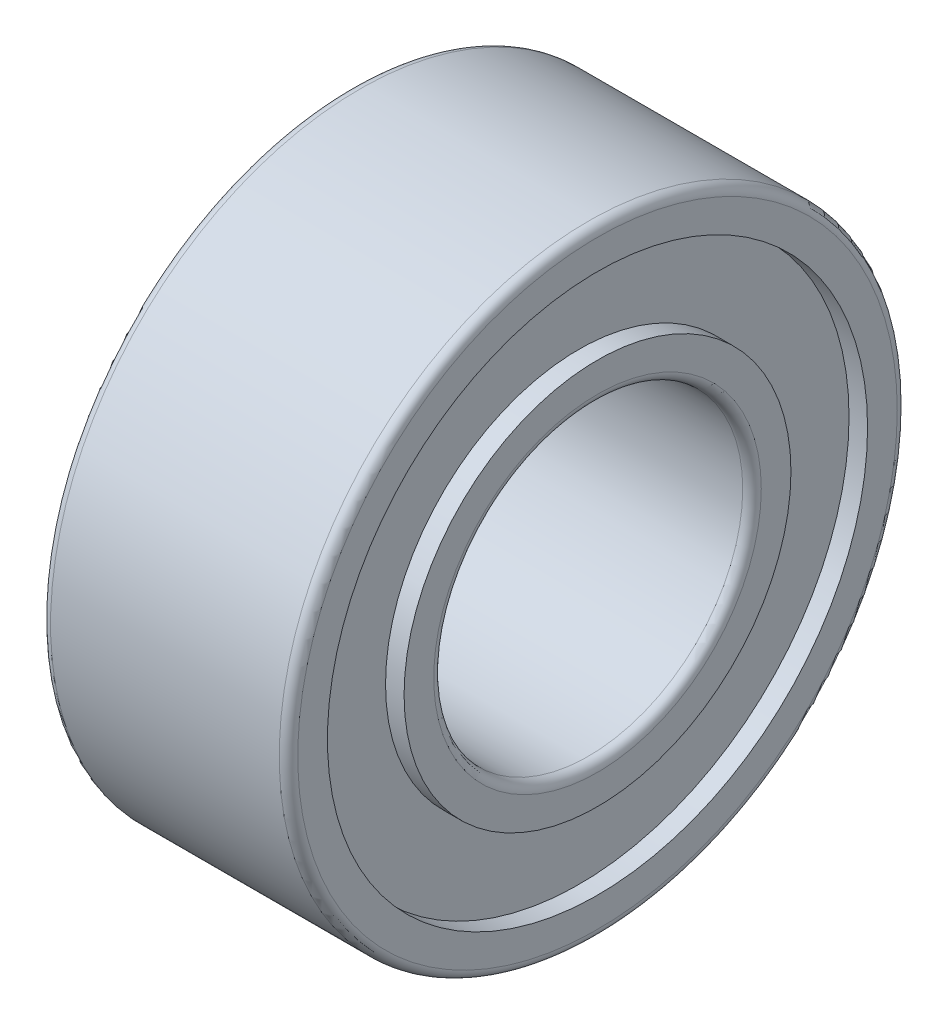
ISO-10303-21;
HEADER;
FILE_DESCRIPTION(('STEP AP214'),'2;1');
FILE_NAME('part.step','',(''),(''),'','','');
FILE_SCHEMA(('AUTOMOTIVE_DESIGN { 1 0 10303 214 1 1 1 1 }'));
ENDSEC;
DATA;
#1=APPLICATION_CONTEXT('core data for automotive mechanical design processes');
#2=APPLICATION_PROTOCOL_DEFINITION('international standard','automotive_design',2000,#1);
#3=PRODUCT_CONTEXT('',#1,'mechanical');
#4=PRODUCT('Part','Part','',(#3));
#5=PRODUCT_RELATED_PRODUCT_CATEGORY('part','',(#4));
#6=PRODUCT_DEFINITION_FORMATION('','',#4);
#7=PRODUCT_DEFINITION_CONTEXT('part definition',#1,'design');
#8=PRODUCT_DEFINITION('design','',#6,#7);
#9=PRODUCT_DEFINITION_SHAPE('','',#8);
#10=(LENGTH_UNIT() NAMED_UNIT(*) SI_UNIT(.MILLI.,.METRE.));
#11=(NAMED_UNIT(*) PLANE_ANGLE_UNIT() SI_UNIT($,.RADIAN.));
#12=(NAMED_UNIT(*) SI_UNIT($,.STERADIAN.) SOLID_ANGLE_UNIT());
#13=UNCERTAINTY_MEASURE_WITH_UNIT(LENGTH_MEASURE(1.E-05),#10,'distance_accuracy_value','');
#14=(GEOMETRIC_REPRESENTATION_CONTEXT(3) GLOBAL_UNCERTAINTY_ASSIGNED_CONTEXT((#13)) GLOBAL_UNIT_ASSIGNED_CONTEXT((#10,
#11,#12)) REPRESENTATION_CONTEXT('',''));
#15=CARTESIAN_POINT('',(0.,0.,0.));
#16=DIRECTION('',(0.,0.,1.));
#17=DIRECTION('',(1.,0.,0.));
#18=AXIS2_PLACEMENT_3D('',#15,#16,#17);
#19=CARTESIAN_POINT('',(3.7,0.,4.37));
#20=DIRECTION('',(1.,0.,0.));
#21=DIRECTION('',(0.,1.,0.));
#22=AXIS2_PLACEMENT_3D('',#19,#20,#21);
#23=PLANE('',#22);
#24=CARTESIAN_POINT('',(3.7,0.,0.));
#25=DIRECTION('',(-1.,0.,0.));
#26=DIRECTION('',(0.,0.,1.));
#27=AXIS2_PLACEMENT_3D('',#24,#25,#26);
#28=CIRCLE('',#27,3.13);
#29=CARTESIAN_POINT('',(3.7,0.,-3.13));
#30=VERTEX_POINT('',#29);
#31=EDGE_CURVE('E25',#30,#30,#28,.T.);
#32=ORIENTED_EDGE('',*,*,#31,.T.);
#33=EDGE_LOOP('',(#32));
#34=FACE_BOUND('',#33,.T.);
#35=CARTESIAN_POINT('',(3.7,0.,0.));
#36=DIRECTION('',(-1.,0.,0.));
#37=DIRECTION('',(0.,0.,1.));
#38=AXIS2_PLACEMENT_3D('',#35,#36,#37);
#39=CIRCLE('',#38,4.37);
#40=CARTESIAN_POINT('',(3.7,0.,-4.37));
#41=VERTEX_POINT('',#40);
#42=EDGE_CURVE('E128',#41,#41,#39,.T.);
#43=ORIENTED_EDGE('',*,*,#42,.F.);
#44=EDGE_LOOP('',(#43));
#45=FACE_BOUND('',#44,.T.);
#46=ADVANCED_FACE('F16',(#34,#45),#23,.T.);
#47=CARTESIAN_POINT('',(3.85,0.,0.));
#48=DIRECTION('',(-1.,0.,0.));
#49=DIRECTION('',(0.,0.,1.));
#50=AXIS2_PLACEMENT_3D('',#47,#48,#49);
#51=CYLINDRICAL_SURFACE('',#50,3.13);
#52=ORIENTED_EDGE('',*,*,#31,.F.);
#53=DIRECTION('',(1.,0.,0.));
#54=VECTOR('',#53,1.);
#55=CARTESIAN_POINT('',(3.85,0.,-3.13));
#56=LINE('',#55,#54);
#57=CARTESIAN_POINT('',(4.,0.,-3.13));
#58=VERTEX_POINT('',#57);
#59=EDGE_CURVE('E10',#30,#58,#56,.T.);
#60=ORIENTED_EDGE('',*,*,#59,.T.);
#61=CARTESIAN_POINT('',(4.,0.,0.));
#62=DIRECTION('',(-1.,0.,0.));
#63=DIRECTION('',(0.,0.,1.));
#64=AXIS2_PLACEMENT_3D('',#61,#62,#63);
#65=CIRCLE('',#64,3.13);
#66=EDGE_CURVE('E352',#58,#58,#65,.T.);
#67=ORIENTED_EDGE('',*,*,#66,.T.);
#68=ORIENTED_EDGE('',*,*,#59,.F.);
#69=EDGE_LOOP('',(#52,#60,#67,#68));
#70=FACE_BOUND('',#69,.T.);
#71=ADVANCED_FACE('F177',(#70),#51,.T.);
#72=CARTESIAN_POINT('',(0.15,0.,0.));
#73=DIRECTION('',(-1.,0.,0.));
#74=DIRECTION('',(0.,0.,1.));
#75=AXIS2_PLACEMENT_3D('',#72,#73,#74);
#76=CYLINDRICAL_SURFACE('',#75,3.13);
#77=CARTESIAN_POINT('',(0.,0.,0.));
#78=DIRECTION('',(-1.,0.,0.));
#79=DIRECTION('',(0.,0.,1.));
#80=AXIS2_PLACEMENT_3D('',#77,#78,#79);
#81=CIRCLE('',#80,3.13);
#82=CARTESIAN_POINT('',(0.,0.,-3.13));
#83=VERTEX_POINT('',#82);
#84=EDGE_CURVE('E130',#83,#83,#81,.T.);
#85=ORIENTED_EDGE('',*,*,#84,.F.);
#86=DIRECTION('',(1.,0.,0.));
#87=VECTOR('',#86,1.);
#88=CARTESIAN_POINT('',(0.15,0.,-3.13));
#89=LINE('',#88,#87);
#90=CARTESIAN_POINT('',(0.3,0.,-3.13));
#91=VERTEX_POINT('',#90);
#92=EDGE_CURVE('E110',#83,#91,#89,.T.);
#93=ORIENTED_EDGE('',*,*,#92,.T.);
#94=CARTESIAN_POINT('',(0.3,0.,0.));
#95=DIRECTION('',(-1.,0.,0.));
#96=DIRECTION('',(0.,0.,1.));
#97=AXIS2_PLACEMENT_3D('',#94,#95,#96);
#98=CIRCLE('',#97,3.13);
#99=EDGE_CURVE('E99',#91,#91,#98,.T.);
#100=ORIENTED_EDGE('',*,*,#99,.T.);
#101=ORIENTED_EDGE('',*,*,#92,.F.);
#102=EDGE_LOOP('',(#85,#93,#100,#101));
#103=FACE_BOUND('',#102,.T.);
#104=ADVANCED_FACE('F170',(#103),#76,.T.);
#105=CARTESIAN_POINT('',(0.3,0.,3.13));
#106=DIRECTION('',(-1.,0.,0.));
#107=DIRECTION('',(0.,0.,1.));
#108=AXIS2_PLACEMENT_3D('',#105,#106,#107);
#109=PLANE('',#108);
#110=ORIENTED_EDGE('',*,*,#99,.F.);
#111=EDGE_LOOP('',(#110));
#112=FACE_BOUND('',#111,.T.);
#113=CARTESIAN_POINT('',(0.3,0.,0.));
#114=DIRECTION('',(-1.,0.,0.));
#115=DIRECTION('',(0.,0.,1.));
#116=AXIS2_PLACEMENT_3D('',#113,#114,#115);
#117=CIRCLE('',#116,4.37);
#118=CARTESIAN_POINT('',(0.3,0.,-4.37));
#119=VERTEX_POINT('',#118);
#120=EDGE_CURVE('E92',#119,#119,#117,.T.);
#121=ORIENTED_EDGE('',*,*,#120,.T.);
#122=EDGE_LOOP('',(#121));
#123=FACE_BOUND('',#122,.T.);
#124=ADVANCED_FACE('F96',(#112,#123),#109,.T.);
#125=CARTESIAN_POINT('',(0.15,0.,0.));
#126=DIRECTION('',(-1.,0.,0.));
#127=DIRECTION('',(0.,0.,1.));
#128=AXIS2_PLACEMENT_3D('',#125,#126,#127);
#129=CYLINDRICAL_SURFACE('',#128,4.37);
#130=CARTESIAN_POINT('',(0.,0.,0.));
#131=DIRECTION('',(-1.,0.,0.));
#132=DIRECTION('',(0.,0.,1.));
#133=AXIS2_PLACEMENT_3D('',#130,#131,#132);
#134=CIRCLE('',#133,4.37);
#135=CARTESIAN_POINT('',(0.,0.,-4.37));
#136=VERTEX_POINT('',#135);
#137=EDGE_CURVE('E150',#136,#136,#134,.T.);
#138=ORIENTED_EDGE('',*,*,#137,.T.);
#139=DIRECTION('',(1.,0.,0.));
#140=VECTOR('',#139,1.);
#141=CARTESIAN_POINT('',(0.15,0.,-4.37));
#142=LINE('',#141,#140);
#143=EDGE_CURVE('E101',#136,#119,#142,.T.);
#144=ORIENTED_EDGE('',*,*,#143,.T.);
#145=ORIENTED_EDGE('',*,*,#120,.F.);
#146=ORIENTED_EDGE('',*,*,#143,.F.);
#147=EDGE_LOOP('',(#138,#144,#145,#146));
#148=FACE_BOUND('',#147,.T.);
#149=ADVANCED_FACE('F171',(#148),#129,.F.);
#150=CARTESIAN_POINT('',(3.85,0.,0.));
#151=DIRECTION('',(-1.,0.,0.));
#152=DIRECTION('',(0.,0.,1.));
#153=AXIS2_PLACEMENT_3D('',#150,#151,#152);
#154=CYLINDRICAL_SURFACE('',#153,4.37);
#155=ORIENTED_EDGE('',*,*,#42,.T.);
#156=DIRECTION('',(1.,0.,0.));
#157=VECTOR('',#156,1.);
#158=CARTESIAN_POINT('',(3.85,0.,-4.37));
#159=LINE('',#158,#157);
#160=CARTESIAN_POINT('',(4.,0.,-4.37));
#161=VERTEX_POINT('',#160);
#162=EDGE_CURVE('E108',#41,#161,#159,.T.);
#163=ORIENTED_EDGE('',*,*,#162,.T.);
#164=CARTESIAN_POINT('',(4.,0.,0.));
#165=DIRECTION('',(-1.,0.,0.));
#166=DIRECTION('',(0.,0.,1.));
#167=AXIS2_PLACEMENT_3D('',#164,#165,#166);
#168=CIRCLE('',#167,4.37);
#169=EDGE_CURVE('E141',#161,#161,#168,.T.);
#170=ORIENTED_EDGE('',*,*,#169,.F.);
#171=ORIENTED_EDGE('',*,*,#162,.F.);
#172=EDGE_LOOP('',(#155,#163,#170,#171));
#173=FACE_BOUND('',#172,.T.);
#174=ADVANCED_FACE('F164',(#173),#154,.F.);
#175=CARTESIAN_POINT('',(0.,0.,2.5));
#176=DIRECTION('',(-1.,0.,0.));
#177=DIRECTION('',(0.,0.,1.));
#178=AXIS2_PLACEMENT_3D('',#175,#176,#177);
#179=PLANE('',#178);
#180=CARTESIAN_POINT('',(0.,0.,0.));
#181=DIRECTION('',(-1.,0.,0.));
#182=DIRECTION('',(0.,0.,-1.));
#183=AXIS2_PLACEMENT_3D('',#180,#181,#182);
#184=CIRCLE('',#183,2.65);
#185=CARTESIAN_POINT('',(0.,0.,-2.65));
#186=VERTEX_POINT('',#185);
#187=EDGE_CURVE('E122',#186,#186,#184,.T.);
#188=ORIENTED_EDGE('',*,*,#187,.F.);
#189=EDGE_LOOP('',(#188));
#190=FACE_BOUND('',#189,.T.);
#191=ORIENTED_EDGE('',*,*,#84,.T.);
#192=EDGE_LOOP('',(#191));
#193=FACE_BOUND('',#192,.T.);
#194=ADVANCED_FACE('F165',(#190,#193),#179,.T.);
#195=CARTESIAN_POINT('',(0.15,0.,0.));
#196=DIRECTION('',(-1.,0.,0.));
#197=DIRECTION('',(0.,0.,1.));
#198=AXIS2_PLACEMENT_3D('',#195,#196,#197);
#199=TOROIDAL_SURFACE('',#198,2.65,0.15);
#200=CARTESIAN_POINT('',(0.15,0.,0.));
#201=DIRECTION('',(1.,0.,0.));
#202=DIRECTION('',(0.,0.,-1.));
#203=AXIS2_PLACEMENT_3D('',#200,#201,#202);
#204=CIRCLE('',#203,2.5);
#205=CARTESIAN_POINT('',(0.15,0.,-2.5));
#206=VERTEX_POINT('',#205);
#207=EDGE_CURVE('E346',#206,#206,#204,.T.);
#208=ORIENTED_EDGE('',*,*,#207,.T.);
#209=CARTESIAN_POINT('',(0.15,0.,-2.65));
#210=DIRECTION('',(0.,-1.,0.));
#211=DIRECTION('',(0.,0.,-1.));
#212=AXIS2_PLACEMENT_3D('',#209,#210,#211);
#213=CIRCLE('',#212,0.15);
#214=EDGE_CURVE('E151',#206,#186,#213,.T.);
#215=ORIENTED_EDGE('',*,*,#214,.T.);
#216=ORIENTED_EDGE('',*,*,#187,.T.);
#217=ORIENTED_EDGE('',*,*,#214,.F.);
#218=EDGE_LOOP('',(#208,#215,#216,#217));
#219=FACE_BOUND('',#218,.T.);
#220=ADVANCED_FACE('F157',(#219),#199,.T.);
#221=CARTESIAN_POINT('',(0.,0.,4.37));
#222=DIRECTION('',(-1.,0.,0.));
#223=DIRECTION('',(0.,0.,1.));
#224=AXIS2_PLACEMENT_3D('',#221,#222,#223);
#225=PLANE('',#224);
#226=ORIENTED_EDGE('',*,*,#137,.F.);
#227=EDGE_LOOP('',(#226));
#228=FACE_BOUND('',#227,.T.);
#229=CARTESIAN_POINT('',(0.,0.,0.));
#230=DIRECTION('',(1.,0.,0.));
#231=DIRECTION('',(0.,0.,-1.));
#232=AXIS2_PLACEMENT_3D('',#229,#230,#231);
#233=CIRCLE('',#232,4.85);
#234=CARTESIAN_POINT('',(0.,0.,-4.85));
#235=VERTEX_POINT('',#234);
#236=EDGE_CURVE('E146',#235,#235,#233,.T.);
#237=ORIENTED_EDGE('',*,*,#236,.F.);
#238=EDGE_LOOP('',(#237));
#239=FACE_BOUND('',#238,.T.);
#240=ADVANCED_FACE('F213',(#228,#239),#225,.T.);
#241=CARTESIAN_POINT('',(0.15,0.,0.));
#242=DIRECTION('',(-1.,0.,0.));
#243=DIRECTION('',(0.,0.,1.));
#244=AXIS2_PLACEMENT_3D('',#241,#242,#243);
#245=TOROIDAL_SURFACE('',#244,4.85,0.15);
#246=ORIENTED_EDGE('',*,*,#236,.T.);
#247=CARTESIAN_POINT('',(0.15,0.,-4.85));
#248=DIRECTION('',(0.,-1.,0.));
#249=DIRECTION('',(0.,0.,-1.));
#250=AXIS2_PLACEMENT_3D('',#247,#248,#249);
#251=CIRCLE('',#250,0.15);
#252=CARTESIAN_POINT('',(0.15,0.,-5.));
#253=VERTEX_POINT('',#252);
#254=EDGE_CURVE('E144',#235,#253,#251,.T.);
#255=ORIENTED_EDGE('',*,*,#254,.T.);
#256=CARTESIAN_POINT('',(0.15,0.,0.));
#257=DIRECTION('',(-1.,0.,0.));
#258=DIRECTION('',(0.,0.,-1.));
#259=AXIS2_PLACEMENT_3D('',#256,#257,#258);
#260=CIRCLE('',#259,5.);
#261=EDGE_CURVE('E340',#253,#253,#260,.T.);
#262=ORIENTED_EDGE('',*,*,#261,.T.);
#263=ORIENTED_EDGE('',*,*,#254,.F.);
#264=EDGE_LOOP('',(#246,#255,#262,#263));
#265=FACE_BOUND('',#264,.T.);
#266=ADVANCED_FACE('F219',(#265),#245,.T.);
#267=CARTESIAN_POINT('',(4.,0.,5.));
#268=DIRECTION('',(1.,0.,0.));
#269=DIRECTION('',(0.,1.,0.));
#270=AXIS2_PLACEMENT_3D('',#267,#268,#269);
#271=PLANE('',#270);
#272=ORIENTED_EDGE('',*,*,#169,.T.);
#273=EDGE_LOOP('',(#272));
#274=FACE_BOUND('',#273,.T.);
#275=CARTESIAN_POINT('',(4.,0.,0.));
#276=DIRECTION('',(-1.,0.,0.));
#277=DIRECTION('',(0.,0.,-1.));
#278=AXIS2_PLACEMENT_3D('',#275,#276,#277);
#279=CIRCLE('',#278,4.85);
#280=CARTESIAN_POINT('',(4.,0.,-4.85));
#281=VERTEX_POINT('',#280);
#282=EDGE_CURVE('E337',#281,#281,#279,.T.);
#283=ORIENTED_EDGE('',*,*,#282,.F.);
#284=EDGE_LOOP('',(#283));
#285=FACE_BOUND('',#284,.T.);
#286=ADVANCED_FACE('F229',(#274,#285),#271,.T.);
#287=CARTESIAN_POINT('',(2.,0.,0.));
#288=DIRECTION('',(-1.,0.,0.));
#289=DIRECTION('',(0.,0.,1.));
#290=AXIS2_PLACEMENT_3D('',#287,#288,#289);
#291=CYLINDRICAL_SURFACE('',#290,5.);
#292=ORIENTED_EDGE('',*,*,#261,.F.);
#293=DIRECTION('',(1.,0.,0.));
#294=VECTOR('',#293,1.);
#295=CARTESIAN_POINT('',(2.,0.,-5.));
#296=LINE('',#295,#294);
#297=CARTESIAN_POINT('',(3.85,0.,-5.));
#298=VERTEX_POINT('',#297);
#299=EDGE_CURVE('E342',#253,#298,#296,.T.);
#300=ORIENTED_EDGE('',*,*,#299,.T.);
#301=CARTESIAN_POINT('',(3.85,0.,0.));
#302=DIRECTION('',(1.,0.,0.));
#303=DIRECTION('',(0.,0.,-1.));
#304=AXIS2_PLACEMENT_3D('',#301,#302,#303);
#305=CIRCLE('',#304,5.);
#306=EDGE_CURVE('E339',#298,#298,#305,.T.);
#307=ORIENTED_EDGE('',*,*,#306,.F.);
#308=ORIENTED_EDGE('',*,*,#299,.F.);
#309=EDGE_LOOP('',(#292,#300,#307,#308));
#310=FACE_BOUND('',#309,.T.);
#311=ADVANCED_FACE('F236',(#310),#291,.T.);
#312=CARTESIAN_POINT('',(3.85,0.,0.));
#313=DIRECTION('',(-1.,0.,0.));
#314=DIRECTION('',(0.,0.,1.));
#315=AXIS2_PLACEMENT_3D('',#312,#313,#314);
#316=TOROIDAL_SURFACE('',#315,4.85,0.15);
#317=ORIENTED_EDGE('',*,*,#306,.T.);
#318=CARTESIAN_POINT('',(3.85,0.,-4.85));
#319=DIRECTION('',(0.,-1.,0.));
#320=DIRECTION('',(0.,0.,-1.));
#321=AXIS2_PLACEMENT_3D('',#318,#319,#320);
#322=CIRCLE('',#321,0.15);
#323=EDGE_CURVE('E333',#298,#281,#322,.T.);
#324=ORIENTED_EDGE('',*,*,#323,.T.);
#325=ORIENTED_EDGE('',*,*,#282,.T.);
#326=ORIENTED_EDGE('',*,*,#323,.F.);
#327=EDGE_LOOP('',(#317,#324,#325,#326));
#328=FACE_BOUND('',#327,.T.);
#329=ADVANCED_FACE('F244',(#328),#316,.T.);
#330=CARTESIAN_POINT('',(4.,0.,3.13));
#331=DIRECTION('',(1.,0.,0.));
#332=DIRECTION('',(0.,1.,0.));
#333=AXIS2_PLACEMENT_3D('',#330,#331,#332);
#334=PLANE('',#333);
#335=CARTESIAN_POINT('',(4.,0.,0.));
#336=DIRECTION('',(1.,0.,0.));
#337=DIRECTION('',(0.,0.,-1.));
#338=AXIS2_PLACEMENT_3D('',#335,#336,#337);
#339=CIRCLE('',#338,2.65);
#340=CARTESIAN_POINT('',(4.,0.,-2.65));
#341=VERTEX_POINT('',#340);
#342=EDGE_CURVE('E322',#341,#341,#339,.T.);
#343=ORIENTED_EDGE('',*,*,#342,.F.);
#344=EDGE_LOOP('',(#343));
#345=FACE_BOUND('',#344,.T.);
#346=ORIENTED_EDGE('',*,*,#66,.F.);
#347=EDGE_LOOP('',(#346));
#348=FACE_BOUND('',#347,.T.);
#349=ADVANCED_FACE('F255',(#345,#348),#334,.T.);
#350=CARTESIAN_POINT('',(2.,0.,0.));
#351=DIRECTION('',(-1.,0.,0.));
#352=DIRECTION('',(0.,0.,1.));
#353=AXIS2_PLACEMENT_3D('',#350,#351,#352);
#354=CYLINDRICAL_SURFACE('',#353,2.5);
#355=ORIENTED_EDGE('',*,*,#207,.F.);
#356=DIRECTION('',(1.,0.,0.));
#357=VECTOR('',#356,1.);
#358=CARTESIAN_POINT('',(2.,0.,-2.5));
#359=LINE('',#358,#357);
#360=CARTESIAN_POINT('',(3.85,0.,-2.5));
#361=VERTEX_POINT('',#360);
#362=EDGE_CURVE('E349',#206,#361,#359,.T.);
#363=ORIENTED_EDGE('',*,*,#362,.T.);
#364=CARTESIAN_POINT('',(3.85,0.,0.));
#365=DIRECTION('',(-1.,0.,0.));
#366=DIRECTION('',(0.,0.,-1.));
#367=AXIS2_PLACEMENT_3D('',#364,#365,#366);
#368=CIRCLE('',#367,2.5);
#369=EDGE_CURVE('E335',#361,#361,#368,.T.);
#370=ORIENTED_EDGE('',*,*,#369,.F.);
#371=ORIENTED_EDGE('',*,*,#362,.F.);
#372=EDGE_LOOP('',(#355,#363,#370,#371));
#373=FACE_BOUND('',#372,.T.);
#374=ADVANCED_FACE('F265',(#373),#354,.F.);
#375=CARTESIAN_POINT('',(3.85,0.,0.));
#376=DIRECTION('',(-1.,0.,0.));
#377=DIRECTION('',(0.,0.,1.));
#378=AXIS2_PLACEMENT_3D('',#375,#376,#377);
#379=TOROIDAL_SURFACE('',#378,2.65,0.15);
#380=ORIENTED_EDGE('',*,*,#342,.T.);
#381=CARTESIAN_POINT('',(3.85,0.,-2.65));
#382=DIRECTION('',(0.,-1.,0.));
#383=DIRECTION('',(0.,0.,-1.));
#384=AXIS2_PLACEMENT_3D('',#381,#382,#383);
#385=CIRCLE('',#384,0.15);
#386=EDGE_CURVE('E326',#341,#361,#385,.T.);
#387=ORIENTED_EDGE('',*,*,#386,.T.);
#388=ORIENTED_EDGE('',*,*,#369,.T.);
#389=ORIENTED_EDGE('',*,*,#386,.F.);
#390=EDGE_LOOP('',(#380,#387,#388,#389));
#391=FACE_BOUND('',#390,.T.);
#392=ADVANCED_FACE('F271',(#391),#379,.T.);
#393=CLOSED_SHELL('',(#46,#71,#104,#124,#149,#174,#194,#220,#240,#266,#286,#311,#329,#349,#374,#392));
#394=MANIFOLD_SOLID_BREP('B1',#393);
#395=ADVANCED_BREP_SHAPE_REPRESENTATION('',(#18,#394),#14);
#396=SHAPE_DEFINITION_REPRESENTATION(#9,#395);
ENDSEC;
END-ISO-10303-21;
